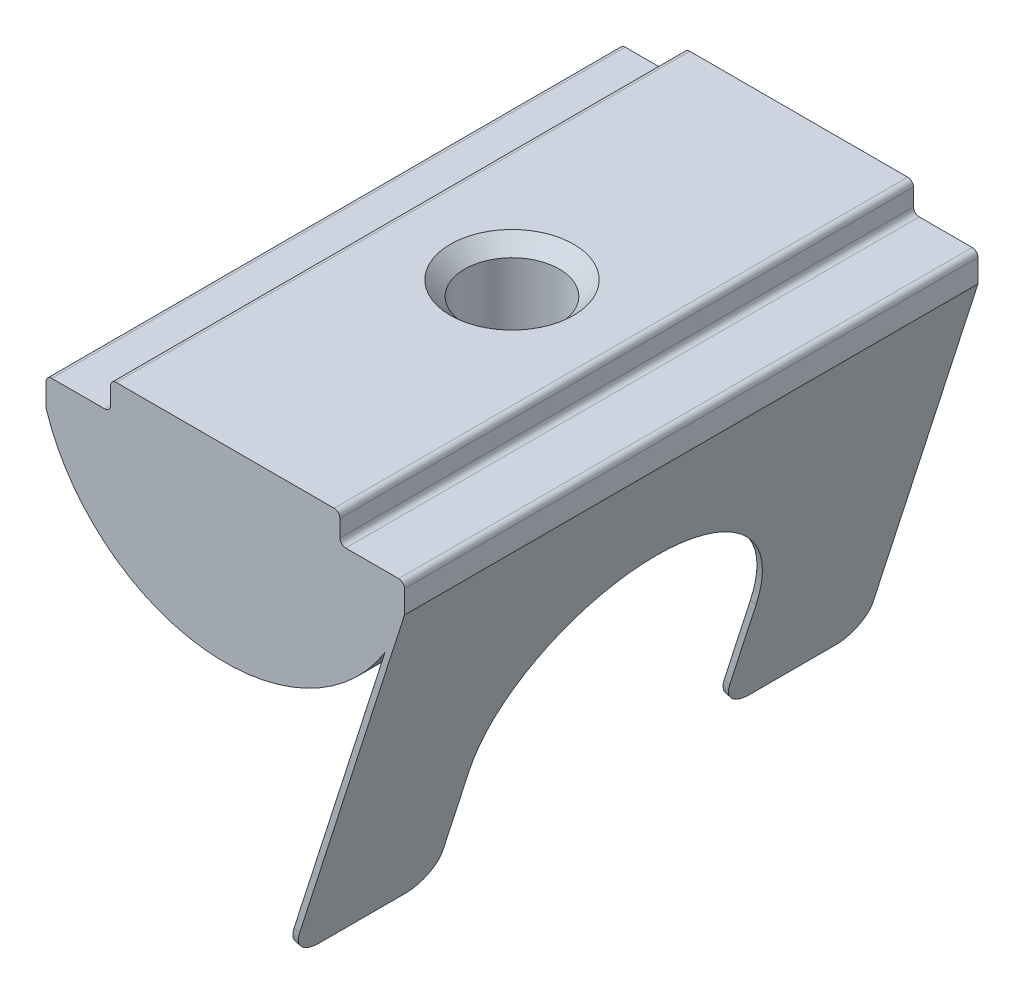
ISO-10303-21;
HEADER;
FILE_DESCRIPTION(('STEP AP214'),'2;1');
FILE_NAME('part.step','',(''),(''),'','','');
FILE_SCHEMA(('AUTOMOTIVE_DESIGN { 1 0 10303 214 1 1 1 1 }'));
ENDSEC;
DATA;
#1=APPLICATION_CONTEXT('core data for automotive mechanical design processes');
#2=APPLICATION_PROTOCOL_DEFINITION('international standard','automotive_design',2000,#1);
#3=PRODUCT_CONTEXT('',#1,'mechanical');
#4=PRODUCT('Part','Part','',(#3));
#5=PRODUCT_RELATED_PRODUCT_CATEGORY('part','',(#4));
#6=PRODUCT_DEFINITION_FORMATION('','',#4);
#7=PRODUCT_DEFINITION_CONTEXT('part definition',#1,'design');
#8=PRODUCT_DEFINITION('design','',#6,#7);
#9=PRODUCT_DEFINITION_SHAPE('','',#8);
#10=(LENGTH_UNIT() NAMED_UNIT(*) SI_UNIT(.MILLI.,.METRE.));
#11=(NAMED_UNIT(*) PLANE_ANGLE_UNIT() SI_UNIT($,.RADIAN.));
#12=(NAMED_UNIT(*) SI_UNIT($,.STERADIAN.) SOLID_ANGLE_UNIT());
#13=UNCERTAINTY_MEASURE_WITH_UNIT(LENGTH_MEASURE(1.E-05),#10,'distance_accuracy_value','');
#14=(GEOMETRIC_REPRESENTATION_CONTEXT(3) GLOBAL_UNCERTAINTY_ASSIGNED_CONTEXT((#13)) GLOBAL_UNIT_ASSIGNED_CONTEXT((#10,
#11,#12)) REPRESENTATION_CONTEXT('',''));
#15=CARTESIAN_POINT('',(0.,0.,0.));
#16=DIRECTION('',(0.,0.,1.));
#17=DIRECTION('',(1.,0.,0.));
#18=AXIS2_PLACEMENT_3D('',#15,#16,#17);
#19=CARTESIAN_POINT('',(2.09743071821094,-14.3205587681705,10.));
#20=DIRECTION('',(0.304775727103784,0.952424147199324,0.));
#21=DIRECTION('',(-0.952424147199324,0.304775727103784,0.));
#22=AXIS2_PLACEMENT_3D('',#19,#20,#21);
#23=PLANE('',#22);
#24=DIRECTION('',(0.,0.,-1.));
#25=VECTOR('',#24,1.);
#26=CARTESIAN_POINT('',(2.09743071821094,-14.3205587681705,10.));
#27=LINE('',#26,#25);
#28=CARTESIAN_POINT('',(2.09743071821094,-14.3205587681705,9.));
#29=VERTEX_POINT('',#28);
#30=CARTESIAN_POINT('',(2.09743071821094,-14.3205587681705,6.));
#31=VERTEX_POINT('',#30);
#32=EDGE_CURVE('E408',#29,#31,#27,.T.);
#33=ORIENTED_EDGE('',*,*,#32,.T.);
#34=DIRECTION('',(0.952424147199324,-0.304775727103784,0.));
#35=VECTOR('',#34,1.);
#36=CARTESIAN_POINT('',(2.09743071821094,-14.3205587681705,6.));
#37=LINE('',#36,#35);
#38=CARTESIAN_POINT('',(2.28791554765081,-14.3815139135912,6.));
#39=VERTEX_POINT('',#38);
#40=EDGE_CURVE('E364',#31,#39,#37,.T.);
#41=ORIENTED_EDGE('',*,*,#40,.T.);
#42=DIRECTION('',(0.,0.,-1.));
#43=VECTOR('',#42,1.);
#44=CARTESIAN_POINT('',(2.28791554765081,-14.3815139135912,10.));
#45=LINE('',#44,#43);
#46=CARTESIAN_POINT('',(2.28791554765081,-14.3815139135912,9.));
#47=VERTEX_POINT('',#46);
#48=EDGE_CURVE('E339',#47,#39,#45,.T.);
#49=ORIENTED_EDGE('',*,*,#48,.F.);
#50=DIRECTION('',(0.952424147199324,-0.304775727103784,0.));
#51=VECTOR('',#50,1.);
#52=CARTESIAN_POINT('',(2.09743071821094,-14.3205587681705,9.));
#53=LINE('',#52,#51);
#54=EDGE_CURVE('E362',#47,#29,#53,.F.);
#55=ORIENTED_EDGE('',*,*,#54,.T.);
#56=EDGE_LOOP('',(#33,#41,#49,#55));
#57=FACE_BOUND('',#56,.T.);
#58=ADVANCED_FACE('F37',(#57),#23,.F.);
#59=CARTESIAN_POINT('',(0.,0.,10.));
#60=DIRECTION('',(0.,0.,-1.));
#61=DIRECTION('',(-1.,0.,0.));
#62=AXIS2_PLACEMENT_3D('',#59,#60,#61);
#63=CYLINDRICAL_SURFACE('',#62,6.56220237420334);
#64=CARTESIAN_POINT('',(0.,-6.56220237420334,1.65));
#65=CARTESIAN_POINT('',(0.0911465699725093,-6.56220084465472,1.64999747323428));
#66=CARTESIAN_POINT('',(0.182321263634086,-6.56028448584091,1.64242214868128));
#67=CARTESIAN_POINT('',(0.362056452824585,-6.55282547783377,1.61236707812998));
#68=CARTESIAN_POINT('',(0.450615456568725,-6.54728079953088,1.58987899219116));
#69=CARTESIAN_POINT('',(0.622497870380307,-6.53317897020506,1.5307664217749));
#70=CARTESIAN_POINT('',(0.705827465999427,-6.52462546042665,1.49415901914898));
#71=CARTESIAN_POINT('',(0.865162951676979,-6.50541633185578,1.40790733223062));
#72=CARTESIAN_POINT('',(0.941168573902343,-6.49476063623111,1.35826257141737));
#73=CARTESIAN_POINT('',(1.08528068169072,-6.47225542325887,1.24625393910073));
#74=CARTESIAN_POINT('',(1.15321300537511,-6.460387317291,1.18366971236991));
#75=CARTESIAN_POINT('',(1.27773631367546,-6.43691803740917,1.0480304037991));
#76=CARTESIAN_POINT('',(1.33432600324174,-6.42531689410948,0.974974127940205));
#77=CARTESIAN_POINT('',(1.43537929692255,-6.4035074252856,0.819109037148414));
#78=CARTESIAN_POINT('',(1.47964761171466,-6.39332268608565,0.736170008116467));
#79=CARTESIAN_POINT('',(1.55354549547654,-6.37577045264015,0.563729824824177));
#80=CARTESIAN_POINT('',(1.58317743455914,-6.36840250230711,0.474229735713662));
#81=CARTESIAN_POINT('',(1.62636638030658,-6.35750919418608,0.293124250498835));
#82=CARTESIAN_POINT('',(1.64023675532044,-6.35390904476299,0.201598188228968));
#83=CARTESIAN_POINT('',(1.65248501145784,-6.3507351222367,0.0174528732494303));
#84=CARTESIAN_POINT('',(1.65086544406689,-6.35116068602251,-0.075166196911044));
#85=CARTESIAN_POINT('',(1.6324297075957,-6.35592290113811,-0.25646300206841));
#86=CARTESIAN_POINT('',(1.6159874358406,-6.36016331877001,-0.345181681254754));
#87=CARTESIAN_POINT('',(1.56896967631972,-6.37192402815559,-0.518559132854629));
#88=CARTESIAN_POINT('',(1.53839317133796,-6.37944455597085,-0.603217612578633));
#89=CARTESIAN_POINT('',(1.46365744495137,-6.39700612835267,-0.767071757790848));
#90=CARTESIAN_POINT('',(1.41936291600343,-6.40707208971074,-0.846202925210303));
#91=CARTESIAN_POINT('',(1.31854311212408,-6.42857633883874,-0.996043144729269));
#92=CARTESIAN_POINT('',(1.26201567424059,-6.44001486913881,-1.06675070398272));
#93=CARTESIAN_POINT('',(1.13640001591119,-6.46338022509953,-1.19987870165637));
#94=CARTESIAN_POINT('',(1.06699640233795,-6.47531161636008,-1.26200112054782));
#95=CARTESIAN_POINT('',(0.91861323583601,-6.4980208146596,-1.37378232366671));
#96=CARTESIAN_POINT('',(0.839633383826206,-6.50879858564938,-1.42344071847414));
#97=CARTESIAN_POINT('',(0.673911417471358,-6.52804083792541,-1.50899550847864));
#98=CARTESIAN_POINT('',(0.587143053260161,-6.53649707428332,-1.54484303157067));
#99=CARTESIAN_POINT('',(0.408551609952149,-6.55008353883238,-1.6013597812184));
#100=CARTESIAN_POINT('',(0.316729512956953,-6.55521441078934,-1.62203194571361));
#101=CARTESIAN_POINT('',(0.13318472375123,-6.56147659445402,-1.64715495882011));
#102=CARTESIAN_POINT('',(0.0415209052098423,-6.56270793505259,-1.65201159410124));
#103=CARTESIAN_POINT('',(-0.141309914830642,-6.56131744414824,-1.64647929626515));
#104=CARTESIAN_POINT('',(-0.232476960843278,-6.55869596377338,-1.63609175243115));
#105=CARTESIAN_POINT('',(-0.41031303892221,-6.54995852868515,-1.60070030435224));
#106=CARTESIAN_POINT('',(-0.497029053248927,-6.54389563088814,-1.57591819147075));
#107=CARTESIAN_POINT('',(-0.66506817941467,-6.52895906976587,-1.51269476944069));
#108=CARTESIAN_POINT('',(-0.746390742010012,-6.52008512070633,-1.4742520716893));
#109=CARTESIAN_POINT('',(-0.902945823871202,-6.50027167480603,-1.38401514495956));
#110=CARTESIAN_POINT('',(-0.978043232686064,-6.48929803978517,-1.33199418497377));
#111=CARTESIAN_POINT('',(-1.11858648322552,-6.46655561170397,-1.21636682464018));
#112=CARTESIAN_POINT('',(-1.18403063537711,-6.45478667997023,-1.15275840052643));
#113=CARTESIAN_POINT('',(-1.30508506172939,-6.43141934506268,-1.01387679346158));
#114=CARTESIAN_POINT('',(-1.36041054043116,-6.41983244770383,-0.938353014131709));
#115=CARTESIAN_POINT('',(-1.45760282589661,-6.39846699767141,-0.778854214872512));
#116=CARTESIAN_POINT('',(-1.49947022839064,-6.38868836496199,-0.694879569242304));
#117=CARTESIAN_POINT('',(-1.56824558656684,-6.37215485258287,-0.521311213081838));
#118=CARTESIAN_POINT('',(-1.59524213297826,-6.36538211381737,-0.431754396517959));
#119=CARTESIAN_POINT('',(-1.63374115581257,-6.35561104533575,-0.249176526999833));
#120=CARTESIAN_POINT('',(-1.64524706757122,-6.35261187876961,-0.156156246836899));
#121=CARTESIAN_POINT('',(-1.65225715632105,-6.35079183938667,0.0278085089343851));
#122=CARTESIAN_POINT('',(-1.64821672983404,-6.35185205129155,0.118734731017917));
#123=CARTESIAN_POINT('',(-1.62529227144884,-6.35775607987862,0.298564704093682));
#124=CARTESIAN_POINT('',(-1.60640854455733,-6.36259981881521,0.387468496605067));
#125=CARTESIAN_POINT('',(-1.55458356836304,-6.37545847052499,0.560228256416546));
#126=CARTESIAN_POINT('',(-1.52172866611081,-6.38345388298008,0.644111677794062));
#127=CARTESIAN_POINT('',(-1.44296215737881,-6.40171754046581,0.805235872626494));
#128=CARTESIAN_POINT('',(-1.39704871930715,-6.41198610428413,0.882475712271049));
#129=CARTESIAN_POINT('',(-1.29204474939321,-6.43397738023748,1.03031854549789));
#130=CARTESIAN_POINT('',(-1.23263866786138,-6.44573129747605,1.10069281776506));
#131=CARTESIAN_POINT('',(-1.10294941177526,-6.46918365843471,1.2306219020766));
#132=CARTESIAN_POINT('',(-1.03266365333881,-6.48088208829474,1.29017413660471));
#133=CARTESIAN_POINT('',(-0.881651154701874,-6.50316198448847,1.39783658739326));
#134=CARTESIAN_POINT('',(-0.800756265877781,-6.51371897145432,1.44571640263186));
#135=CARTESIAN_POINT('',(-0.631807047378436,-6.53226747620662,1.52712102463529));
#136=CARTESIAN_POINT('',(-0.5437578565565,-6.54026081536829,1.56065602852666));
#137=CARTESIAN_POINT('',(-0.379899735457833,-6.55161204144299,1.60749164440219));
#138=CARTESIAN_POINT('',(-0.304865388606907,-6.55555599893336,1.62339760953959));
#139=CARTESIAN_POINT('',(-0.153227238747475,-6.5608517084017,1.64465244284918));
#140=CARTESIAN_POINT('',(-0.0766235570821754,-6.56220366003841,1.65000212415867));
#141=CARTESIAN_POINT('',(0.,-6.56220237420334,1.65));
#142=B_SPLINE_CURVE_WITH_KNOTS('',3,(#64,#65,#66,#67,#68,#69,#70,#71,#72,#73,#74,#75,#76,#77,
#78,#79,#80,#81,#82,#83,#84,#85,#86,#87,#88,#89,#90,#91,#92,#93,#94,#95,#96,#97,#98,#99,#100,
#101,#102,#103,#104,#105,#106,#107,#108,#109,#110,#111,#112,#113,#114,#115,#116,#117,#118,#119,
#120,#121,#122,#123,#124,#125,#126,#127,#128,#129,#130,#131,#132,#133,#134,#135,#136,#137,#138,
#139,#140,#141),.UNSPECIFIED.,.T.,.F.,(4,2,2,2,2,2,2,2,2,2,2,2,2,2,2,2,2,2,2,2,2,2,2,2,2,2,2,2,
2,2,2,2,2,2,2,2,2,2,4),(0.,0.27315889586945,0.546470684437711,0.819452846520269,
1.09244498760208,1.37053876786725,1.64866428153456,1.93097506189691,2.21324011181646,
2.48978925814414,2.76629285239913,3.03601109555888,3.30574875289033,3.57823658984154,
3.85077264593572,4.13117323154922,4.41158257677417,4.69297527825237,4.97431348791007,
5.2483739196933,5.52240937644078,5.79233046913537,6.06227900724789,6.33706088709644,
6.61189080405545,6.8935504627651,7.17519765191266,7.45514830886784,7.73503687133626,
8.00678999815624,8.27853754101904,8.54862944945075,8.81875925970588,9.09601231447367,
9.37333131710943,9.65574700617762,9.93796160276473,10.1676138945249,10.3972484957663),.UNSPECIFIED.);
#143=CARTESIAN_POINT('',(0.,-6.56220237420334,1.65));
#144=VERTEX_POINT('',#143);
#145=EDGE_CURVE('E273',#144,#144,#142,.T.);
#146=ORIENTED_EDGE('',*,*,#145,.T.);
#147=EDGE_LOOP('',(#146));
#148=FACE_BOUND('',#147,.T.);
#149=DIRECTION('',(0.,0.,-1.));
#150=VECTOR('',#149,1.);
#151=CARTESIAN_POINT('',(5.56951001555688,-3.47031096396441,10.));
#152=LINE('',#151,#150);
#153=CARTESIAN_POINT('',(5.56951001555688,-3.47031096396441,10.));
#154=VERTEX_POINT('',#153);
#155=CARTESIAN_POINT('',(5.56951001555688,-3.47031096396441,-10.));
#156=VERTEX_POINT('',#155);
#157=EDGE_CURVE('E410',#154,#156,#152,.T.);
#158=ORIENTED_EDGE('',*,*,#157,.F.);
#159=CARTESIAN_POINT('',(0.,0.,10.));
#160=DIRECTION('',(0.,0.,1.));
#161=DIRECTION('',(1.,0.,0.));
#162=AXIS2_PLACEMENT_3D('',#159,#160,#161);
#163=CIRCLE('',#162,6.56220237420334);
#164=CARTESIAN_POINT('',(-6.25,-2.,10.));
#165=VERTEX_POINT('',#164);
#166=EDGE_CURVE('E238',#165,#154,#163,.T.);
#167=ORIENTED_EDGE('',*,*,#166,.F.);
#168=DIRECTION('',(0.,0.,-1.));
#169=VECTOR('',#168,1.);
#170=CARTESIAN_POINT('',(-6.25,-2.,10.));
#171=LINE('',#170,#169);
#172=CARTESIAN_POINT('',(-6.25,-2.,-10.));
#173=VERTEX_POINT('',#172);
#174=EDGE_CURVE('E232',#165,#173,#171,.T.);
#175=ORIENTED_EDGE('',*,*,#174,.T.);
#176=CARTESIAN_POINT('',(0.,0.,-10.));
#177=DIRECTION('',(0.,0.,1.));
#178=DIRECTION('',(1.,0.,0.));
#179=AXIS2_PLACEMENT_3D('',#176,#177,#178);
#180=CIRCLE('',#179,6.56220237420334);
#181=EDGE_CURVE('E262',#173,#156,#180,.T.);
#182=ORIENTED_EDGE('',*,*,#181,.T.);
#183=EDGE_LOOP('',(#158,#167,#175,#182));
#184=FACE_BOUND('',#183,.T.);
#185=ADVANCED_FACE('F283',(#148,#184),#63,.T.);
#186=CARTESIAN_POINT('',(4.,-0.999999999999999,10.));
#187=DIRECTION('',(-1.,0.,0.));
#188=DIRECTION('',(0.,0.,1.));
#189=AXIS2_PLACEMENT_3D('',#186,#187,#188);
#190=PLANE('',#189);
#191=DIRECTION('',(0.,1.,0.));
#192=VECTOR('',#191,1.);
#193=CARTESIAN_POINT('',(4.,-0.999999999999999,10.));
#194=LINE('',#193,#192);
#195=CARTESIAN_POINT('',(4.,-0.799999999999998,10.));
#196=VERTEX_POINT('',#195);
#197=CARTESIAN_POINT('',(4.,-0.2,10.));
#198=VERTEX_POINT('',#197);
#199=EDGE_CURVE('E269',#196,#198,#194,.T.);
#200=ORIENTED_EDGE('',*,*,#199,.F.);
#201=DIRECTION('',(0.,0.,-1.));
#202=VECTOR('',#201,1.);
#203=CARTESIAN_POINT('',(4.,-0.799999999999998,-10.));
#204=LINE('',#203,#202);
#205=CARTESIAN_POINT('',(4.,-0.799999999999998,-10.));
#206=VERTEX_POINT('',#205);
#207=EDGE_CURVE('E488',#196,#206,#204,.T.);
#208=ORIENTED_EDGE('',*,*,#207,.T.);
#209=DIRECTION('',(0.,1.,0.));
#210=VECTOR('',#209,1.);
#211=CARTESIAN_POINT('',(4.,-0.999999999999999,-10.));
#212=LINE('',#211,#210);
#213=CARTESIAN_POINT('',(4.,-0.2,-10.));
#214=VERTEX_POINT('',#213);
#215=EDGE_CURVE('E247',#206,#214,#212,.T.);
#216=ORIENTED_EDGE('',*,*,#215,.T.);
#217=DIRECTION('',(0.,0.,-1.));
#218=VECTOR('',#217,1.);
#219=CARTESIAN_POINT('',(4.,-0.2,10.));
#220=LINE('',#219,#218);
#221=EDGE_CURVE('E491',#214,#198,#220,.F.);
#222=ORIENTED_EDGE('',*,*,#221,.T.);
#223=EDGE_LOOP('',(#200,#208,#216,#222));
#224=FACE_BOUND('',#223,.T.);
#225=ADVANCED_FACE('F318',(#224),#190,.F.);
#226=CARTESIAN_POINT('',(-4.,0.,10.));
#227=DIRECTION('',(0.,-1.,0.));
#228=DIRECTION('',(0.,0.,-1.));
#229=AXIS2_PLACEMENT_3D('',#226,#227,#228);
#230=PLANE('',#229);
#231=CARTESIAN_POINT('',(0.,0.,0.));
#232=DIRECTION('',(0.,1.,0.));
#233=DIRECTION('',(0.,0.,1.));
#234=AXIS2_PLACEMENT_3D('',#231,#232,#233);
#235=CIRCLE('',#234,2.15);
#236=CARTESIAN_POINT('',(0.,0.,2.15));
#237=VERTEX_POINT('',#236);
#238=EDGE_CURVE('E413',#237,#237,#235,.T.);
#239=ORIENTED_EDGE('',*,*,#238,.F.);
#240=EDGE_LOOP('',(#239));
#241=FACE_BOUND('',#240,.T.);
#242=DIRECTION('',(-1.,0.,0.));
#243=VECTOR('',#242,1.);
#244=CARTESIAN_POINT('',(-4.,0.,10.));
#245=LINE('',#244,#243);
#246=CARTESIAN_POINT('',(3.8,0.,10.));
#247=VERTEX_POINT('',#246);
#248=CARTESIAN_POINT('',(-3.8,0.,10.));
#249=VERTEX_POINT('',#248);
#250=EDGE_CURVE('E420',#247,#249,#245,.T.);
#251=ORIENTED_EDGE('',*,*,#250,.F.);
#252=DIRECTION('',(0.,0.,-1.));
#253=VECTOR('',#252,1.);
#254=CARTESIAN_POINT('',(3.8,0.,10.));
#255=LINE('',#254,#253);
#256=CARTESIAN_POINT('',(3.8,0.,-10.));
#257=VERTEX_POINT('',#256);
#258=EDGE_CURVE('E483',#247,#257,#255,.T.);
#259=ORIENTED_EDGE('',*,*,#258,.T.);
#260=DIRECTION('',(-1.,0.,0.));
#261=VECTOR('',#260,1.);
#262=CARTESIAN_POINT('',(-4.,0.,-10.));
#263=LINE('',#262,#261);
#264=CARTESIAN_POINT('',(-3.8,0.,-10.));
#265=VERTEX_POINT('',#264);
#266=EDGE_CURVE('E250',#257,#265,#263,.T.);
#267=ORIENTED_EDGE('',*,*,#266,.T.);
#268=DIRECTION('',(0.,0.,-1.));
#269=VECTOR('',#268,1.);
#270=CARTESIAN_POINT('',(-3.8,0.,10.));
#271=LINE('',#270,#269);
#272=EDGE_CURVE('E486',#265,#249,#271,.F.);
#273=ORIENTED_EDGE('',*,*,#272,.T.);
#274=EDGE_LOOP('',(#251,#259,#267,#273));
#275=FACE_BOUND('',#274,.T.);
#276=ADVANCED_FACE('F529',(#241,#275),#230,.F.);
#277=CARTESIAN_POINT('',(-4.,0.,10.));
#278=DIRECTION('',(1.,0.,0.));
#279=DIRECTION('',(0.,0.,-1.));
#280=AXIS2_PLACEMENT_3D('',#277,#278,#279);
#281=PLANE('',#280);
#282=DIRECTION('',(0.,-1.,0.));
#283=VECTOR('',#282,1.);
#284=CARTESIAN_POINT('',(-4.,0.,-10.));
#285=LINE('',#284,#283);
#286=CARTESIAN_POINT('',(-4.,-0.2,-10.));
#287=VERTEX_POINT('',#286);
#288=CARTESIAN_POINT('',(-4.,-0.8,-10.));
#289=VERTEX_POINT('',#288);
#290=EDGE_CURVE('E254',#287,#289,#285,.T.);
#291=ORIENTED_EDGE('',*,*,#290,.T.);
#292=DIRECTION('',(0.,0.,-1.));
#293=VECTOR('',#292,1.);
#294=CARTESIAN_POINT('',(-4.,-0.8,10.));
#295=LINE('',#294,#293);
#296=CARTESIAN_POINT('',(-4.,-0.8,10.));
#297=VERTEX_POINT('',#296);
#298=EDGE_CURVE('E471',#289,#297,#295,.F.);
#299=ORIENTED_EDGE('',*,*,#298,.T.);
#300=DIRECTION('',(0.,-1.,0.));
#301=VECTOR('',#300,1.);
#302=CARTESIAN_POINT('',(-4.,0.,10.));
#303=LINE('',#302,#301);
#304=CARTESIAN_POINT('',(-4.,-0.2,10.));
#305=VERTEX_POINT('',#304);
#306=EDGE_CURVE('E423',#305,#297,#303,.T.);
#307=ORIENTED_EDGE('',*,*,#306,.F.);
#308=DIRECTION('',(0.,0.,-1.));
#309=VECTOR('',#308,1.);
#310=CARTESIAN_POINT('',(-4.,-0.2,10.));
#311=LINE('',#310,#309);
#312=EDGE_CURVE('E473',#305,#287,#311,.T.);
#313=ORIENTED_EDGE('',*,*,#312,.T.);
#314=EDGE_LOOP('',(#291,#299,#307,#313));
#315=FACE_BOUND('',#314,.T.);
#316=ADVANCED_FACE('F538',(#315),#281,.F.);
#317=CARTESIAN_POINT('',(-4.,-1.,10.));
#318=DIRECTION('',(0.,-1.,0.));
#319=DIRECTION('',(1.,0.,0.));
#320=AXIS2_PLACEMENT_3D('',#317,#318,#319);
#321=PLANE('',#320);
#322=DIRECTION('',(-1.,0.,0.));
#323=VECTOR('',#322,1.);
#324=CARTESIAN_POINT('',(-4.,-1.,-10.));
#325=LINE('',#324,#323);
#326=CARTESIAN_POINT('',(-4.2,-1.,-10.));
#327=VERTEX_POINT('',#326);
#328=CARTESIAN_POINT('',(-6.05,-1.,-10.));
#329=VERTEX_POINT('',#328);
#330=EDGE_CURVE('E257',#327,#329,#325,.T.);
#331=ORIENTED_EDGE('',*,*,#330,.T.);
#332=DIRECTION('',(0.,0.,-1.));
#333=VECTOR('',#332,1.);
#334=CARTESIAN_POINT('',(-6.05,-1.,10.));
#335=LINE('',#334,#333);
#336=CARTESIAN_POINT('',(-6.05,-1.,10.));
#337=VERTEX_POINT('',#336);
#338=EDGE_CURVE('E476',#329,#337,#335,.F.);
#339=ORIENTED_EDGE('',*,*,#338,.T.);
#340=DIRECTION('',(-1.,0.,0.));
#341=VECTOR('',#340,1.);
#342=CARTESIAN_POINT('',(-4.,-1.,10.));
#343=LINE('',#342,#341);
#344=CARTESIAN_POINT('',(-4.2,-1.,10.));
#345=VERTEX_POINT('',#344);
#346=EDGE_CURVE('E426',#345,#337,#343,.T.);
#347=ORIENTED_EDGE('',*,*,#346,.F.);
#348=DIRECTION('',(0.,0.,-1.));
#349=VECTOR('',#348,1.);
#350=CARTESIAN_POINT('',(-4.2,-1.,-10.));
#351=LINE('',#350,#349);
#352=EDGE_CURVE('E478',#345,#327,#351,.T.);
#353=ORIENTED_EDGE('',*,*,#352,.T.);
#354=EDGE_LOOP('',(#331,#339,#347,#353));
#355=FACE_BOUND('',#354,.T.);
#356=ADVANCED_FACE('F309',(#355),#321,.F.);
#357=CARTESIAN_POINT('',(-6.25,-1.,10.));
#358=DIRECTION('',(1.,0.,0.));
#359=DIRECTION('',(0.,1.,0.));
#360=AXIS2_PLACEMENT_3D('',#357,#358,#359);
#361=PLANE('',#360);
#362=DIRECTION('',(0.,-1.,0.));
#363=VECTOR('',#362,1.);
#364=CARTESIAN_POINT('',(-6.25,-1.,10.));
#365=LINE('',#364,#363);
#366=CARTESIAN_POINT('',(-6.25,-1.2,10.));
#367=VERTEX_POINT('',#366);
#368=EDGE_CURVE('E243',#367,#165,#365,.T.);
#369=ORIENTED_EDGE('',*,*,#368,.F.);
#370=DIRECTION('',(0.,0.,-1.));
#371=VECTOR('',#370,1.);
#372=CARTESIAN_POINT('',(-6.25,-1.2,10.));
#373=LINE('',#372,#371);
#374=CARTESIAN_POINT('',(-6.25,-1.2,-10.));
#375=VERTEX_POINT('',#374);
#376=EDGE_CURVE('E481',#367,#375,#373,.T.);
#377=ORIENTED_EDGE('',*,*,#376,.T.);
#378=DIRECTION('',(0.,-1.,0.));
#379=VECTOR('',#378,1.);
#380=CARTESIAN_POINT('',(-6.25,-1.,-10.));
#381=LINE('',#380,#379);
#382=EDGE_CURVE('E260',#375,#173,#381,.T.);
#383=ORIENTED_EDGE('',*,*,#382,.T.);
#384=ORIENTED_EDGE('',*,*,#174,.F.);
#385=EDGE_LOOP('',(#369,#377,#383,#384));
#386=FACE_BOUND('',#385,.T.);
#387=ADVANCED_FACE('F305',(#386),#361,.F.);
#388=CARTESIAN_POINT('',(6.25,-0.999999999999999,10.));
#389=DIRECTION('',(-1.,0.,0.));
#390=DIRECTION('',(0.,0.,1.));
#391=AXIS2_PLACEMENT_3D('',#388,#389,#390);
#392=PLANE('',#391);
#393=DIRECTION('',(0.,1.,0.));
#394=VECTOR('',#393,1.);
#395=CARTESIAN_POINT('',(6.25,-0.999999999999999,-10.));
#396=LINE('',#395,#394);
#397=CARTESIAN_POINT('',(6.25,-2.,-10.));
#398=VERTEX_POINT('',#397);
#399=CARTESIAN_POINT('',(6.25,-1.2,-10.));
#400=VERTEX_POINT('',#399);
#401=EDGE_CURVE('E265',#398,#400,#396,.T.);
#402=ORIENTED_EDGE('',*,*,#401,.T.);
#403=DIRECTION('',(0.,0.,-1.));
#404=VECTOR('',#403,1.);
#405=CARTESIAN_POINT('',(6.25,-1.2,10.));
#406=LINE('',#405,#404);
#407=CARTESIAN_POINT('',(6.25,-1.2,10.));
#408=VERTEX_POINT('',#407);
#409=EDGE_CURVE('E237',#400,#408,#406,.F.);
#410=ORIENTED_EDGE('',*,*,#409,.T.);
#411=DIRECTION('',(0.,1.,0.));
#412=VECTOR('',#411,1.);
#413=CARTESIAN_POINT('',(6.25,-0.999999999999999,10.));
#414=LINE('',#413,#412);
#415=CARTESIAN_POINT('',(6.25,-2.,10.));
#416=VERTEX_POINT('',#415);
#417=EDGE_CURVE('E216',#416,#408,#414,.T.);
#418=ORIENTED_EDGE('',*,*,#417,.F.);
#419=DIRECTION('',(0.,0.,-1.));
#420=VECTOR('',#419,1.);
#421=CARTESIAN_POINT('',(6.25,-2.,10.));
#422=LINE('',#421,#420);
#423=EDGE_CURVE('E224',#416,#398,#422,.T.);
#424=ORIENTED_EDGE('',*,*,#423,.T.);
#425=EDGE_LOOP('',(#402,#410,#418,#424));
#426=FACE_BOUND('',#425,.T.);
#427=ADVANCED_FACE('F235',(#426),#392,.F.);
#428=CARTESIAN_POINT('',(4.,-0.999999999999999,10.));
#429=DIRECTION('',(0.,-1.,0.));
#430=DIRECTION('',(1.,0.,0.));
#431=AXIS2_PLACEMENT_3D('',#428,#429,#430);
#432=PLANE('',#431);
#433=DIRECTION('',(-1.,0.,0.));
#434=VECTOR('',#433,1.);
#435=CARTESIAN_POINT('',(4.,-0.999999999999999,10.));
#436=LINE('',#435,#434);
#437=CARTESIAN_POINT('',(6.05,-0.999999999999999,10.));
#438=VERTEX_POINT('',#437);
#439=CARTESIAN_POINT('',(4.2,-0.999999999999999,10.));
#440=VERTEX_POINT('',#439);
#441=EDGE_CURVE('E233',#438,#440,#436,.T.);
#442=ORIENTED_EDGE('',*,*,#441,.F.);
#443=DIRECTION('',(0.,0.,-1.));
#444=VECTOR('',#443,1.);
#445=CARTESIAN_POINT('',(6.05,-0.999999999999999,10.));
#446=LINE('',#445,#444);
#447=CARTESIAN_POINT('',(6.05,-0.999999999999999,-10.));
#448=VERTEX_POINT('',#447);
#449=EDGE_CURVE('E508',#438,#448,#446,.T.);
#450=ORIENTED_EDGE('',*,*,#449,.T.);
#451=DIRECTION('',(-1.,0.,0.));
#452=VECTOR('',#451,1.);
#453=CARTESIAN_POINT('',(4.,-0.999999999999999,-10.));
#454=LINE('',#453,#452);
#455=CARTESIAN_POINT('',(4.2,-0.999999999999999,-10.));
#456=VERTEX_POINT('',#455);
#457=EDGE_CURVE('E267',#448,#456,#454,.T.);
#458=ORIENTED_EDGE('',*,*,#457,.T.);
#459=DIRECTION('',(0.,0.,-1.));
#460=VECTOR('',#459,1.);
#461=CARTESIAN_POINT('',(4.2,-0.999999999999999,10.));
#462=LINE('',#461,#460);
#463=EDGE_CURVE('E281',#456,#440,#462,.F.);
#464=ORIENTED_EDGE('',*,*,#463,.T.);
#465=EDGE_LOOP('',(#442,#450,#458,#464));
#466=FACE_BOUND('',#465,.T.);
#467=ADVANCED_FACE('F298',(#466),#432,.F.);
#468=CARTESIAN_POINT('',(0.,0.,10.));
#469=DIRECTION('',(0.,0.,1.));
#470=DIRECTION('',(1.,0.,0.));
#471=AXIS2_PLACEMENT_3D('',#468,#469,#470);
#472=PLANE('',#471);
#473=DIRECTION('',(-0.304775727103784,-0.952424147199324,0.));
#474=VECTOR('',#473,1.);
#475=CARTESIAN_POINT('',(6.05951517056013,-1.93904485457925,10.));
#476=LINE('',#475,#474);
#477=CARTESIAN_POINT('',(2.40220644531473,-13.3681346209711,10.));
#478=VERTEX_POINT('',#477);
#479=EDGE_CURVE('E221',#154,#478,#476,.T.);
#480=ORIENTED_EDGE('',*,*,#479,.T.);
#481=DIRECTION('',(0.952424147199324,-0.304775727103784,0.));
#482=VECTOR('',#481,1.);
#483=CARTESIAN_POINT('',(2.59269127475459,-13.4290897663919,10.));
#484=LINE('',#483,#482);
#485=CARTESIAN_POINT('',(2.59269127475459,-13.4290897663919,10.));
#486=VERTEX_POINT('',#485);
#487=EDGE_CURVE('E219',#478,#486,#484,.T.);
#488=ORIENTED_EDGE('',*,*,#487,.T.);
#489=DIRECTION('',(0.304775727103784,0.952424147199324,0.));
#490=VECTOR('',#489,1.);
#491=CARTESIAN_POINT('',(6.25,-2.,10.));
#492=LINE('',#491,#490);
#493=EDGE_CURVE('E211',#486,#416,#492,.T.);
#494=ORIENTED_EDGE('',*,*,#493,.T.);
#495=ORIENTED_EDGE('',*,*,#417,.T.);
#496=CARTESIAN_POINT('',(6.05,-1.2,10.));
#497=DIRECTION('',(0.,0.,1.));
#498=DIRECTION('',(1.,0.,0.));
#499=AXIS2_PLACEMENT_3D('',#496,#497,#498);
#500=CIRCLE('',#499,0.2);
#501=EDGE_CURVE('E493',#408,#438,#500,.T.);
#502=ORIENTED_EDGE('',*,*,#501,.T.);
#503=ORIENTED_EDGE('',*,*,#441,.T.);
#504=CARTESIAN_POINT('',(4.2,-0.799999999999998,10.));
#505=DIRECTION('',(0.,0.,1.));
#506=DIRECTION('',(1.,0.,0.));
#507=AXIS2_PLACEMENT_3D('',#504,#505,#506);
#508=CIRCLE('',#507,0.2);
#509=EDGE_CURVE('E467',#440,#196,#508,.F.);
#510=ORIENTED_EDGE('',*,*,#509,.T.);
#511=ORIENTED_EDGE('',*,*,#199,.T.);
#512=CARTESIAN_POINT('',(3.8,-0.2,10.));
#513=DIRECTION('',(0.,0.,1.));
#514=DIRECTION('',(1.,0.,0.));
#515=AXIS2_PLACEMENT_3D('',#512,#513,#514);
#516=CIRCLE('',#515,0.2);
#517=EDGE_CURVE('E495',#198,#247,#516,.T.);
#518=ORIENTED_EDGE('',*,*,#517,.T.);
#519=ORIENTED_EDGE('',*,*,#250,.T.);
#520=CARTESIAN_POINT('',(-3.8,-0.2,10.));
#521=DIRECTION('',(0.,0.,1.));
#522=DIRECTION('',(1.,0.,0.));
#523=AXIS2_PLACEMENT_3D('',#520,#521,#522);
#524=CIRCLE('',#523,0.2);
#525=EDGE_CURVE('E498',#249,#305,#524,.T.);
#526=ORIENTED_EDGE('',*,*,#525,.T.);
#527=ORIENTED_EDGE('',*,*,#306,.T.);
#528=CARTESIAN_POINT('',(-4.2,-0.8,10.));
#529=DIRECTION('',(0.,0.,1.));
#530=DIRECTION('',(1.,0.,0.));
#531=AXIS2_PLACEMENT_3D('',#528,#529,#530);
#532=CIRCLE('',#531,0.2);
#533=EDGE_CURVE('E463',#297,#345,#532,.F.);
#534=ORIENTED_EDGE('',*,*,#533,.T.);
#535=ORIENTED_EDGE('',*,*,#346,.T.);
#536=CARTESIAN_POINT('',(-6.05,-1.2,10.));
#537=DIRECTION('',(0.,0.,1.));
#538=DIRECTION('',(1.,0.,0.));
#539=AXIS2_PLACEMENT_3D('',#536,#537,#538);
#540=CIRCLE('',#539,0.2);
#541=EDGE_CURVE('E432',#337,#367,#540,.T.);
#542=ORIENTED_EDGE('',*,*,#541,.T.);
#543=ORIENTED_EDGE('',*,*,#368,.T.);
#544=ORIENTED_EDGE('',*,*,#166,.T.);
#545=EDGE_LOOP('',(#480,#488,#494,#495,#502,#503,#510,#511,#518,#519,#526,#527,#534,#535,#542,
#543,#544));
#546=FACE_BOUND('',#545,.T.);
#547=ADVANCED_FACE('F214',(#546),#472,.T.);
#548=CARTESIAN_POINT('',(0.,0.,-10.));
#549=DIRECTION('',(0.,0.,1.));
#550=DIRECTION('',(1.,0.,0.));
#551=AXIS2_PLACEMENT_3D('',#548,#549,#550);
#552=PLANE('',#551);
#553=DIRECTION('',(0.304775727103784,0.952424147199324,0.));
#554=VECTOR('',#553,1.);
#555=CARTESIAN_POINT('',(6.25,-2.,-10.));
#556=LINE('',#555,#554);
#557=CARTESIAN_POINT('',(2.59269127475459,-13.4290897663919,-10.));
#558=VERTEX_POINT('',#557);
#559=EDGE_CURVE('E228',#558,#398,#556,.T.);
#560=ORIENTED_EDGE('',*,*,#559,.F.);
#561=DIRECTION('',(0.952424147199324,-0.304775727103784,0.));
#562=VECTOR('',#561,1.);
#563=CARTESIAN_POINT('',(-3.65730872524541,-11.4290897663919,-10.));
#564=LINE('',#563,#562);
#565=CARTESIAN_POINT('',(2.40220644531473,-13.3681346209711,-10.));
#566=VERTEX_POINT('',#565);
#567=EDGE_CURVE('E360',#558,#566,#564,.F.);
#568=ORIENTED_EDGE('',*,*,#567,.T.);
#569=DIRECTION('',(-0.304775727103784,-0.952424147199324,0.));
#570=VECTOR('',#569,1.);
#571=CARTESIAN_POINT('',(6.05951517056013,-1.93904485457925,-10.));
#572=LINE('',#571,#570);
#573=EDGE_CURVE('E386',#156,#566,#572,.T.);
#574=ORIENTED_EDGE('',*,*,#573,.F.);
#575=ORIENTED_EDGE('',*,*,#181,.F.);
#576=ORIENTED_EDGE('',*,*,#382,.F.);
#577=CARTESIAN_POINT('',(-6.05,-1.2,-10.));
#578=DIRECTION('',(0.,0.,1.));
#579=DIRECTION('',(1.,0.,0.));
#580=AXIS2_PLACEMENT_3D('',#577,#578,#579);
#581=CIRCLE('',#580,0.2);
#582=EDGE_CURVE('E505',#375,#329,#581,.F.);
#583=ORIENTED_EDGE('',*,*,#582,.T.);
#584=ORIENTED_EDGE('',*,*,#330,.F.);
#585=CARTESIAN_POINT('',(-4.2,-0.8,-10.));
#586=DIRECTION('',(0.,0.,1.));
#587=DIRECTION('',(1.,0.,0.));
#588=AXIS2_PLACEMENT_3D('',#585,#586,#587);
#589=CIRCLE('',#588,0.2);
#590=EDGE_CURVE('E465',#327,#289,#589,.T.);
#591=ORIENTED_EDGE('',*,*,#590,.T.);
#592=ORIENTED_EDGE('',*,*,#290,.F.);
#593=CARTESIAN_POINT('',(-3.8,-0.2,-10.));
#594=DIRECTION('',(0.,0.,1.));
#595=DIRECTION('',(1.,0.,0.));
#596=AXIS2_PLACEMENT_3D('',#593,#594,#595);
#597=CIRCLE('',#596,0.2);
#598=EDGE_CURVE('E507',#287,#265,#597,.F.);
#599=ORIENTED_EDGE('',*,*,#598,.T.);
#600=ORIENTED_EDGE('',*,*,#266,.F.);
#601=CARTESIAN_POINT('',(3.8,-0.2,-10.));
#602=DIRECTION('',(0.,0.,1.));
#603=DIRECTION('',(1.,0.,0.));
#604=AXIS2_PLACEMENT_3D('',#601,#602,#603);
#605=CIRCLE('',#604,0.2);
#606=EDGE_CURVE('E503',#257,#214,#605,.F.);
#607=ORIENTED_EDGE('',*,*,#606,.T.);
#608=ORIENTED_EDGE('',*,*,#215,.F.);
#609=CARTESIAN_POINT('',(4.2,-0.799999999999998,-10.));
#610=DIRECTION('',(0.,0.,1.));
#611=DIRECTION('',(1.,0.,0.));
#612=AXIS2_PLACEMENT_3D('',#609,#610,#611);
#613=CIRCLE('',#612,0.2);
#614=EDGE_CURVE('E469',#206,#456,#613,.T.);
#615=ORIENTED_EDGE('',*,*,#614,.T.);
#616=ORIENTED_EDGE('',*,*,#457,.F.);
#617=CARTESIAN_POINT('',(6.05,-1.2,-10.));
#618=DIRECTION('',(0.,0.,1.));
#619=DIRECTION('',(1.,0.,0.));
#620=AXIS2_PLACEMENT_3D('',#617,#618,#619);
#621=CIRCLE('',#620,0.2);
#622=EDGE_CURVE('E501',#448,#400,#621,.F.);
#623=ORIENTED_EDGE('',*,*,#622,.T.);
#624=ORIENTED_EDGE('',*,*,#401,.F.);
#625=EDGE_LOOP('',(#560,#568,#574,#575,#576,#583,#584,#591,#592,#599,#600,#607,#608,#615,#616,
#623,#624));
#626=FACE_BOUND('',#625,.T.);
#627=ADVANCED_FACE('F293',(#626),#552,.F.);
#628=CARTESIAN_POINT('',(0.,0.,0.));
#629=DIRECTION('',(0.,1.,0.));
#630=DIRECTION('',(0.,0.,1.));
#631=AXIS2_PLACEMENT_3D('',#628,#629,#630);
#632=CYLINDRICAL_SURFACE('',#631,1.65);
#633=CARTESIAN_POINT('',(0.,-0.499999999999999,0.));
#634=DIRECTION('',(0.,1.,0.));
#635=DIRECTION('',(0.,0.,1.));
#636=AXIS2_PLACEMENT_3D('',#633,#634,#635);
#637=CIRCLE('',#636,1.65);
#638=CARTESIAN_POINT('',(0.,-0.499999999999999,1.65));
#639=VERTEX_POINT('',#638);
#640=EDGE_CURVE('E251',#639,#639,#637,.T.);
#641=ORIENTED_EDGE('',*,*,#640,.T.);
#642=EDGE_LOOP('',(#641));
#643=FACE_BOUND('',#642,.T.);
#644=ORIENTED_EDGE('',*,*,#145,.F.);
#645=EDGE_LOOP('',(#644));
#646=FACE_BOUND('',#645,.T.);
#647=ADVANCED_FACE('F287',(#643,#646),#632,.F.);
#648=CARTESIAN_POINT('',(0.,0.,0.));
#649=DIRECTION('',(0.,1.,0.));
#650=DIRECTION('',(0.,0.,1.));
#651=AXIS2_PLACEMENT_3D('',#648,#649,#650);
#652=CONICAL_SURFACE('',#651,2.15,0.78539816339745);
#653=ORIENTED_EDGE('',*,*,#640,.F.);
#654=EDGE_LOOP('',(#653));
#655=FACE_BOUND('',#654,.T.);
#656=ORIENTED_EDGE('',*,*,#238,.T.);
#657=EDGE_LOOP('',(#656));
#658=FACE_BOUND('',#657,.T.);
#659=ADVANCED_FACE('F292',(#655,#658),#652,.F.);
#660=CARTESIAN_POINT('',(6.05951517056013,-1.93904485457925,10.));
#661=DIRECTION('',(0.952424147199324,-0.304775727103784,0.));
#662=DIRECTION('',(0.304775727103784,0.952424147199324,0.));
#663=AXIS2_PLACEMENT_3D('',#660,#661,#662);
#664=PLANE('',#663);
#665=CARTESIAN_POINT('',(2.09743071821094,-14.3205587681705,-6.));
#666=VERTEX_POINT('',#665);
#667=CARTESIAN_POINT('',(2.09743071821094,-14.3205587681705,-9.));
#668=VERTEX_POINT('',#667);
#669=EDGE_CURVE('E411',#666,#668,#27,.T.);
#670=ORIENTED_EDGE('',*,*,#669,.F.);
#671=CARTESIAN_POINT('',(2.40220644531473,-13.3681346209711,-6.));
#672=DIRECTION('',(0.952424147199324,-0.304775727103784,0.));
#673=DIRECTION('',(0.304775727103784,0.952424147199324,0.));
#674=AXIS2_PLACEMENT_3D('',#671,#672,#673);
#675=CIRCLE('',#674,1.);
#676=CARTESIAN_POINT('',(2.40220644531473,-13.3681346209711,-5.));
#677=VERTEX_POINT('',#676);
#678=EDGE_CURVE('E348',#666,#677,#675,.F.);
#679=ORIENTED_EDGE('',*,*,#678,.T.);
#680=DIRECTION('',(-0.304775727103784,-0.952424147199324,0.));
#681=VECTOR('',#680,1.);
#682=CARTESIAN_POINT('',(2.09743071821094,-14.3205587681705,-5.));
#683=LINE('',#682,#681);
#684=CARTESIAN_POINT('',(3.31653362662608,-10.5108621793732,-5.));
#685=VERTEX_POINT('',#684);
#686=EDGE_CURVE('E391',#685,#677,#683,.T.);
#687=ORIENTED_EDGE('',*,*,#686,.F.);
#688=CARTESIAN_POINT('',(3.31653362662608,-10.5108621793732,0.));
#689=DIRECTION('',(0.952424147199324,-0.304775727103784,0.));
#690=DIRECTION('',(0.304775727103784,0.952424147199324,0.));
#691=AXIS2_PLACEMENT_3D('',#688,#689,#690);
#692=CIRCLE('',#691,5.);
#693=CARTESIAN_POINT('',(4.840412262145,-5.74874144337654,0.));
#694=VERTEX_POINT('',#693);
#695=EDGE_CURVE('E11',#685,#694,#692,.T.);
#696=ORIENTED_EDGE('',*,*,#695,.T.);
#697=CARTESIAN_POINT('',(3.31653362662608,-10.5108621793732,0.));
#698=DIRECTION('',(0.952424147199324,-0.304775727103784,0.));
#699=DIRECTION('',(0.304775727103784,0.952424147199324,0.));
#700=AXIS2_PLACEMENT_3D('',#697,#698,#699);
#701=CIRCLE('',#700,5.);
#702=CARTESIAN_POINT('',(3.31653362662608,-10.5108621793732,5.));
#703=VERTEX_POINT('',#702);
#704=EDGE_CURVE('E376',#694,#703,#701,.T.);
#705=ORIENTED_EDGE('',*,*,#704,.T.);
#706=DIRECTION('',(0.304775727103784,0.952424147199324,0.));
#707=VECTOR('',#706,1.);
#708=CARTESIAN_POINT('',(2.09743071821094,-14.3205587681705,5.));
#709=LINE('',#708,#707);
#710=CARTESIAN_POINT('',(2.40220644531473,-13.3681346209711,5.));
#711=VERTEX_POINT('',#710);
#712=EDGE_CURVE('E396',#711,#703,#709,.T.);
#713=ORIENTED_EDGE('',*,*,#712,.F.);
#714=CARTESIAN_POINT('',(2.40220644531473,-13.3681346209711,6.));
#715=DIRECTION('',(0.952424147199324,-0.304775727103784,0.));
#716=DIRECTION('',(0.304775727103784,0.952424147199324,0.));
#717=AXIS2_PLACEMENT_3D('',#714,#715,#716);
#718=CIRCLE('',#717,1.);
#719=EDGE_CURVE('E351',#711,#31,#718,.F.);
#720=ORIENTED_EDGE('',*,*,#719,.T.);
#721=ORIENTED_EDGE('',*,*,#32,.F.);
#722=CARTESIAN_POINT('',(2.40220644531472,-13.3681346209711,9.));
#723=DIRECTION('',(0.952424147199324,-0.304775727103784,0.));
#724=DIRECTION('',(0.304775727103784,0.952424147199324,0.));
#725=AXIS2_PLACEMENT_3D('',#722,#723,#724);
#726=CIRCLE('',#725,1.);
#727=EDGE_CURVE('E349',#29,#478,#726,.F.);
#728=ORIENTED_EDGE('',*,*,#727,.T.);
#729=ORIENTED_EDGE('',*,*,#479,.F.);
#730=ORIENTED_EDGE('',*,*,#157,.T.);
#731=ORIENTED_EDGE('',*,*,#573,.T.);
#732=CARTESIAN_POINT('',(2.40220644531473,-13.3681346209711,-9.));
#733=DIRECTION('',(0.952424147199324,-0.304775727103784,0.));
#734=DIRECTION('',(0.304775727103784,0.952424147199324,0.));
#735=AXIS2_PLACEMENT_3D('',#732,#733,#734);
#736=CIRCLE('',#735,1.);
#737=EDGE_CURVE('E357',#566,#668,#736,.F.);
#738=ORIENTED_EDGE('',*,*,#737,.T.);
#739=EDGE_LOOP('',(#670,#679,#687,#696,#705,#713,#720,#721,#728,#729,#730,#731,#738));
#740=FACE_BOUND('',#739,.T.);
#741=ADVANCED_FACE('F323',(#740),#664,.F.);
#742=CARTESIAN_POINT('',(2.28791554765081,-14.3815139135912,-6.));
#743=VERTEX_POINT('',#742);
#744=CARTESIAN_POINT('',(2.28791554765081,-14.3815139135912,-9.));
#745=VERTEX_POINT('',#744);
#746=EDGE_CURVE('E220',#743,#745,#45,.T.);
#747=ORIENTED_EDGE('',*,*,#746,.F.);
#748=DIRECTION('',(0.952424147199324,-0.304775727103784,0.));
#749=VECTOR('',#748,1.);
#750=CARTESIAN_POINT('',(2.09743071821094,-14.3205587681705,-6.));
#751=LINE('',#750,#749);
#752=EDGE_CURVE('E335',#743,#666,#751,.F.);
#753=ORIENTED_EDGE('',*,*,#752,.T.);
#754=ORIENTED_EDGE('',*,*,#669,.T.);
#755=DIRECTION('',(0.952424147199324,-0.304775727103784,0.));
#756=VECTOR('',#755,1.);
#757=CARTESIAN_POINT('',(2.09743071821094,-14.3205587681705,-9.));
#758=LINE('',#757,#756);
#759=EDGE_CURVE('E338',#668,#745,#758,.T.);
#760=ORIENTED_EDGE('',*,*,#759,.T.);
#761=EDGE_LOOP('',(#747,#753,#754,#760));
#762=FACE_BOUND('',#761,.T.);
#763=ADVANCED_FACE('F314',(#762),#23,.F.);
#764=CARTESIAN_POINT('',(6.25,-2.,10.));
#765=DIRECTION('',(-0.952424147199324,0.304775727103784,0.));
#766=DIRECTION('',(-0.304775727103784,-0.952424147199324,0.));
#767=AXIS2_PLACEMENT_3D('',#764,#765,#766);
#768=PLANE('',#767);
#769=DIRECTION('',(0.304775727103784,0.952424147199324,0.));
#770=VECTOR('',#769,1.);
#771=CARTESIAN_POINT('',(2.28791554765081,-14.3815139135912,-5.));
#772=LINE('',#771,#770);
#773=CARTESIAN_POINT('',(2.59269127475459,-13.4290897663919,-5.));
#774=VERTEX_POINT('',#773);
#775=CARTESIAN_POINT('',(3.50701845606594,-10.5718173247939,-5.));
#776=VERTEX_POINT('',#775);
#777=EDGE_CURVE('E379',#774,#776,#772,.T.);
#778=ORIENTED_EDGE('',*,*,#777,.F.);
#779=CARTESIAN_POINT('',(2.59269127475459,-13.4290897663919,-6.));
#780=DIRECTION('',(-0.952424147199324,0.304775727103784,0.));
#781=DIRECTION('',(-0.304775727103784,-0.952424147199324,0.));
#782=AXIS2_PLACEMENT_3D('',#779,#780,#781);
#783=CIRCLE('',#782,1.);
#784=EDGE_CURVE('E345',#774,#743,#783,.F.);
#785=ORIENTED_EDGE('',*,*,#784,.T.);
#786=ORIENTED_EDGE('',*,*,#746,.T.);
#787=CARTESIAN_POINT('',(2.59269127475459,-13.4290897663919,-9.));
#788=DIRECTION('',(-0.952424147199324,0.304775727103784,0.));
#789=DIRECTION('',(-0.304775727103784,-0.952424147199324,0.));
#790=AXIS2_PLACEMENT_3D('',#787,#788,#789);
#791=CIRCLE('',#790,1.);
#792=EDGE_CURVE('E444',#745,#558,#791,.F.);
#793=ORIENTED_EDGE('',*,*,#792,.T.);
#794=ORIENTED_EDGE('',*,*,#559,.T.);
#795=ORIENTED_EDGE('',*,*,#423,.F.);
#796=ORIENTED_EDGE('',*,*,#493,.F.);
#797=CARTESIAN_POINT('',(2.59269127475459,-13.4290897663919,9.));
#798=DIRECTION('',(-0.952424147199324,0.304775727103784,0.));
#799=DIRECTION('',(-0.304775727103784,-0.952424147199324,0.));
#800=AXIS2_PLACEMENT_3D('',#797,#798,#799);
#801=CIRCLE('',#800,1.);
#802=EDGE_CURVE('E449',#486,#47,#801,.F.);
#803=ORIENTED_EDGE('',*,*,#802,.T.);
#804=ORIENTED_EDGE('',*,*,#48,.T.);
#805=CARTESIAN_POINT('',(2.59269127475459,-13.4290897663919,6.));
#806=DIRECTION('',(-0.952424147199324,0.304775727103784,0.));
#807=DIRECTION('',(-0.304775727103784,-0.952424147199324,0.));
#808=AXIS2_PLACEMENT_3D('',#805,#806,#807);
#809=CIRCLE('',#808,1.);
#810=CARTESIAN_POINT('',(2.59269127475459,-13.4290897663919,5.));
#811=VERTEX_POINT('',#810);
#812=EDGE_CURVE('E448',#39,#811,#809,.F.);
#813=ORIENTED_EDGE('',*,*,#812,.T.);
#814=DIRECTION('',(-0.304775727103784,-0.952424147199324,0.));
#815=VECTOR('',#814,1.);
#816=CARTESIAN_POINT('',(2.28791554765081,-14.3815139135912,5.));
#817=LINE('',#816,#815);
#818=CARTESIAN_POINT('',(3.50701845606594,-10.5718173247939,5.));
#819=VERTEX_POINT('',#818);
#820=EDGE_CURVE('E387',#819,#811,#817,.T.);
#821=ORIENTED_EDGE('',*,*,#820,.F.);
#822=CARTESIAN_POINT('',(3.50701845606594,-10.5718173247939,0.));
#823=DIRECTION('',(-0.952424147199324,0.304775727103784,0.));
#824=DIRECTION('',(-0.304775727103784,-0.952424147199324,0.));
#825=AXIS2_PLACEMENT_3D('',#822,#823,#824);
#826=CIRCLE('',#825,5.);
#827=CARTESIAN_POINT('',(5.03089709158486,-5.8096965887973,0.));
#828=VERTEX_POINT('',#827);
#829=EDGE_CURVE('E59',#819,#828,#826,.T.);
#830=ORIENTED_EDGE('',*,*,#829,.T.);
#831=CARTESIAN_POINT('',(3.50701845606594,-10.5718173247939,0.));
#832=DIRECTION('',(-0.952424147199324,0.304775727103784,0.));
#833=DIRECTION('',(-0.304775727103784,-0.952424147199324,0.));
#834=AXIS2_PLACEMENT_3D('',#831,#832,#833);
#835=CIRCLE('',#834,5.);
#836=EDGE_CURVE('E46',#828,#776,#835,.T.);
#837=ORIENTED_EDGE('',*,*,#836,.T.);
#838=EDGE_LOOP('',(#778,#785,#786,#793,#794,#795,#796,#803,#804,#813,#821,#830,#837));
#839=FACE_BOUND('',#838,.T.);
#840=ADVANCED_FACE('F226',(#839),#768,.F.);
#841=CARTESIAN_POINT('',(-9.63273031591959,-10.5669072372487,5.));
#842=DIRECTION('',(0.,0.,1.));
#843=DIRECTION('',(1.,0.,0.));
#844=AXIS2_PLACEMENT_3D('',#841,#842,#843);
#845=PLANE('',#844);
#846=ORIENTED_EDGE('',*,*,#712,.T.);
#847=DIRECTION('',(0.952424147199324,-0.304775727103784,0.));
#848=VECTOR('',#847,1.);
#849=CARTESIAN_POINT('',(3.50701845606594,-10.5718173247939,5.));
#850=LINE('',#849,#848);
#851=EDGE_CURVE('E370',#703,#819,#850,.T.);
#852=ORIENTED_EDGE('',*,*,#851,.T.);
#853=ORIENTED_EDGE('',*,*,#820,.T.);
#854=DIRECTION('',(0.952424147199324,-0.304775727103784,0.));
#855=VECTOR('',#854,1.);
#856=CARTESIAN_POINT('',(-9.32795458881581,-9.61448309004936,5.));
#857=LINE('',#856,#855);
#858=EDGE_CURVE('E367',#811,#711,#857,.F.);
#859=ORIENTED_EDGE('',*,*,#858,.T.);
#860=EDGE_LOOP('',(#846,#852,#853,#859));
#861=FACE_BOUND('',#860,.T.);
#862=ADVANCED_FACE('F329',(#861),#845,.F.);
#863=CARTESIAN_POINT('',(-9.63273031591959,-10.5669072372487,-5.));
#864=DIRECTION('',(0.,0.,-1.));
#865=DIRECTION('',(-1.,0.,0.));
#866=AXIS2_PLACEMENT_3D('',#863,#864,#865);
#867=PLANE('',#866);
#868=ORIENTED_EDGE('',*,*,#777,.T.);
#869=DIRECTION('',(0.952424147199324,-0.304775727103784,0.));
#870=VECTOR('',#869,1.);
#871=CARTESIAN_POINT('',(3.31653362662608,-10.5108621793732,-5.));
#872=LINE('',#871,#870);
#873=EDGE_CURVE('E373',#776,#685,#872,.F.);
#874=ORIENTED_EDGE('',*,*,#873,.T.);
#875=ORIENTED_EDGE('',*,*,#686,.T.);
#876=DIRECTION('',(0.952424147199324,-0.304775727103784,0.));
#877=VECTOR('',#876,1.);
#878=CARTESIAN_POINT('',(-9.32795458881581,-9.61448309004936,-5.));
#879=LINE('',#878,#877);
#880=EDGE_CURVE('E385',#677,#774,#879,.T.);
#881=ORIENTED_EDGE('',*,*,#880,.T.);
#882=EDGE_LOOP('',(#868,#874,#875,#881));
#883=FACE_BOUND('',#882,.T.);
#884=ADVANCED_FACE('F384',(#883),#867,.F.);
#885=CARTESIAN_POINT('',(6.05,-1.2,10.));
#886=DIRECTION('',(0.,0.,-1.));
#887=DIRECTION('',(-1.,0.,0.));
#888=AXIS2_PLACEMENT_3D('',#885,#886,#887);
#889=CYLINDRICAL_SURFACE('',#888,0.2);
#890=ORIENTED_EDGE('',*,*,#501,.F.);
#891=ORIENTED_EDGE('',*,*,#409,.F.);
#892=ORIENTED_EDGE('',*,*,#622,.F.);
#893=ORIENTED_EDGE('',*,*,#449,.F.);
#894=EDGE_LOOP('',(#890,#891,#892,#893));
#895=FACE_BOUND('',#894,.T.);
#896=ADVANCED_FACE('F620',(#895),#889,.T.);
#897=CARTESIAN_POINT('',(4.2,-0.799999999999998,10.));
#898=DIRECTION('',(0.,0.,1.));
#899=DIRECTION('',(1.,0.,0.));
#900=AXIS2_PLACEMENT_3D('',#897,#898,#899);
#901=CYLINDRICAL_SURFACE('',#900,0.2);
#902=ORIENTED_EDGE('',*,*,#509,.F.);
#903=ORIENTED_EDGE('',*,*,#463,.F.);
#904=ORIENTED_EDGE('',*,*,#614,.F.);
#905=ORIENTED_EDGE('',*,*,#207,.F.);
#906=EDGE_LOOP('',(#902,#903,#904,#905));
#907=FACE_BOUND('',#906,.T.);
#908=ADVANCED_FACE('F518',(#907),#901,.F.);
#909=CARTESIAN_POINT('',(3.8,-0.2,10.));
#910=DIRECTION('',(0.,0.,-1.));
#911=DIRECTION('',(-1.,0.,0.));
#912=AXIS2_PLACEMENT_3D('',#909,#910,#911);
#913=CYLINDRICAL_SURFACE('',#912,0.2);
#914=ORIENTED_EDGE('',*,*,#517,.F.);
#915=ORIENTED_EDGE('',*,*,#221,.F.);
#916=ORIENTED_EDGE('',*,*,#606,.F.);
#917=ORIENTED_EDGE('',*,*,#258,.F.);
#918=EDGE_LOOP('',(#914,#915,#916,#917));
#919=FACE_BOUND('',#918,.T.);
#920=ADVANCED_FACE('F526',(#919),#913,.T.);
#921=CARTESIAN_POINT('',(-6.05,-1.2,10.));
#922=DIRECTION('',(0.,0.,-1.));
#923=DIRECTION('',(-1.,0.,0.));
#924=AXIS2_PLACEMENT_3D('',#921,#922,#923);
#925=CYLINDRICAL_SURFACE('',#924,0.2);
#926=ORIENTED_EDGE('',*,*,#541,.F.);
#927=ORIENTED_EDGE('',*,*,#338,.F.);
#928=ORIENTED_EDGE('',*,*,#582,.F.);
#929=ORIENTED_EDGE('',*,*,#376,.F.);
#930=EDGE_LOOP('',(#926,#927,#928,#929));
#931=FACE_BOUND('',#930,.T.);
#932=ADVANCED_FACE('F549',(#931),#925,.T.);
#933=CARTESIAN_POINT('',(-4.2,-0.8,10.));
#934=DIRECTION('',(0.,0.,1.));
#935=DIRECTION('',(1.,0.,0.));
#936=AXIS2_PLACEMENT_3D('',#933,#934,#935);
#937=CYLINDRICAL_SURFACE('',#936,0.2);
#938=ORIENTED_EDGE('',*,*,#533,.F.);
#939=ORIENTED_EDGE('',*,*,#298,.F.);
#940=ORIENTED_EDGE('',*,*,#590,.F.);
#941=ORIENTED_EDGE('',*,*,#352,.F.);
#942=EDGE_LOOP('',(#938,#939,#940,#941));
#943=FACE_BOUND('',#942,.T.);
#944=ADVANCED_FACE('F544',(#943),#937,.F.);
#945=CARTESIAN_POINT('',(-3.8,-0.2,10.));
#946=DIRECTION('',(0.,0.,-1.));
#947=DIRECTION('',(-1.,0.,0.));
#948=AXIS2_PLACEMENT_3D('',#945,#946,#947);
#949=CYLINDRICAL_SURFACE('',#948,0.2);
#950=ORIENTED_EDGE('',*,*,#525,.F.);
#951=ORIENTED_EDGE('',*,*,#272,.F.);
#952=ORIENTED_EDGE('',*,*,#598,.F.);
#953=ORIENTED_EDGE('',*,*,#312,.F.);
#954=EDGE_LOOP('',(#950,#951,#952,#953));
#955=FACE_BOUND('',#954,.T.);
#956=ADVANCED_FACE('F535',(#955),#949,.T.);
#957=CARTESIAN_POINT('',(-9.32795458881581,-9.61448309004936,-6.));
#958=DIRECTION('',(0.952424147199324,-0.304775727103784,0.));
#959=DIRECTION('',(0.304775727103784,0.952424147199324,0.));
#960=AXIS2_PLACEMENT_3D('',#957,#958,#959);
#961=CYLINDRICAL_SURFACE('',#960,1.);
#962=ORIENTED_EDGE('',*,*,#678,.F.);
#963=ORIENTED_EDGE('',*,*,#752,.F.);
#964=ORIENTED_EDGE('',*,*,#784,.F.);
#965=ORIENTED_EDGE('',*,*,#880,.F.);
#966=EDGE_LOOP('',(#962,#963,#964,#965));
#967=FACE_BOUND('',#966,.T.);
#968=ADVANCED_FACE('F343',(#967),#961,.T.);
#969=CARTESIAN_POINT('',(2.40220644531472,-13.3681346209711,-9.));
#970=DIRECTION('',(0.952424147199324,-0.304775727103784,0.));
#971=DIRECTION('',(0.304775727103784,0.952424147199324,0.));
#972=AXIS2_PLACEMENT_3D('',#969,#970,#971);
#973=CYLINDRICAL_SURFACE('',#972,1.);
#974=ORIENTED_EDGE('',*,*,#737,.F.);
#975=ORIENTED_EDGE('',*,*,#567,.F.);
#976=ORIENTED_EDGE('',*,*,#792,.F.);
#977=ORIENTED_EDGE('',*,*,#759,.F.);
#978=EDGE_LOOP('',(#974,#975,#976,#977));
#979=FACE_BOUND('',#978,.T.);
#980=ADVANCED_FACE('F443',(#979),#973,.T.);
#981=CARTESIAN_POINT('',(2.40220644531472,-13.3681346209711,6.));
#982=DIRECTION('',(0.952424147199324,-0.304775727103784,0.));
#983=DIRECTION('',(0.304775727103784,0.952424147199324,0.));
#984=AXIS2_PLACEMENT_3D('',#981,#982,#983);
#985=CYLINDRICAL_SURFACE('',#984,1.);
#986=ORIENTED_EDGE('',*,*,#719,.F.);
#987=ORIENTED_EDGE('',*,*,#858,.F.);
#988=ORIENTED_EDGE('',*,*,#812,.F.);
#989=ORIENTED_EDGE('',*,*,#40,.F.);
#990=EDGE_LOOP('',(#986,#987,#988,#989));
#991=FACE_BOUND('',#990,.T.);
#992=ADVANCED_FACE('F457',(#991),#985,.T.);
#993=CARTESIAN_POINT('',(-3.65730872524541,-11.4290897663919,9.));
#994=DIRECTION('',(-0.952424147199324,0.304775727103784,0.));
#995=DIRECTION('',(-0.304775727103784,-0.952424147199324,0.));
#996=AXIS2_PLACEMENT_3D('',#993,#994,#995);
#997=CYLINDRICAL_SURFACE('',#996,1.);
#998=ORIENTED_EDGE('',*,*,#727,.F.);
#999=ORIENTED_EDGE('',*,*,#54,.F.);
#1000=ORIENTED_EDGE('',*,*,#802,.F.);
#1001=ORIENTED_EDGE('',*,*,#487,.F.);
#1002=EDGE_LOOP('',(#998,#999,#1000,#1001));
#1003=FACE_BOUND('',#1002,.T.);
#1004=ADVANCED_FACE('F455',(#1003),#997,.T.);
#1005=CARTESIAN_POINT('',(-8.41362740750445,-6.75721064845139,0.));
#1006=DIRECTION('',(-0.952424147199324,0.304775727103784,0.));
#1007=DIRECTION('',(-0.304775727103784,-0.952424147199324,0.));
#1008=AXIS2_PLACEMENT_3D('',#1005,#1006,#1007);
#1009=CYLINDRICAL_SURFACE('',#1008,5.);
#1010=DIRECTION('',(0.952424147199324,-0.304775727103784,0.));
#1011=VECTOR('',#1010,1.);
#1012=CARTESIAN_POINT('',(5.03089709158486,-5.8096965887973,0.));
#1013=LINE('',#1012,#1011);
#1014=EDGE_CURVE('E41',#694,#828,#1013,.T.);
#1015=ORIENTED_EDGE('',*,*,#1014,.F.);
#1016=ORIENTED_EDGE('',*,*,#695,.F.);
#1017=ORIENTED_EDGE('',*,*,#873,.F.);
#1018=ORIENTED_EDGE('',*,*,#836,.F.);
#1019=EDGE_LOOP('',(#1015,#1016,#1017,#1018));
#1020=FACE_BOUND('',#1019,.T.);
#1021=ADVANCED_FACE('F39',(#1020),#1009,.F.);
#1022=CARTESIAN_POINT('',(-8.41362740750445,-6.75721064845139,0.));
#1023=DIRECTION('',(-0.952424147199324,0.304775727103784,0.));
#1024=DIRECTION('',(-0.304775727103784,-0.952424147199324,0.));
#1025=AXIS2_PLACEMENT_3D('',#1022,#1023,#1024);
#1026=CYLINDRICAL_SURFACE('',#1025,5.);
#1027=ORIENTED_EDGE('',*,*,#704,.F.);
#1028=ORIENTED_EDGE('',*,*,#1014,.T.);
#1029=ORIENTED_EDGE('',*,*,#829,.F.);
#1030=ORIENTED_EDGE('',*,*,#851,.F.);
#1031=EDGE_LOOP('',(#1027,#1028,#1029,#1030));
#1032=FACE_BOUND('',#1031,.T.);
#1033=ADVANCED_FACE('F393',(#1032),#1026,.F.);
#1034=CLOSED_SHELL('',(#58,#185,#225,#276,#316,#356,#387,#427,#467,#547,#627,#647,#659,#741,
#763,#840,#862,#884,#896,#908,#920,#932,#944,#956,#968,#980,#992,#1004,#1021,#1033));
#1035=MANIFOLD_SOLID_BREP('B2',#1034);
#1036=ADVANCED_BREP_SHAPE_REPRESENTATION('',(#18,#1035),#14);
#1037=SHAPE_DEFINITION_REPRESENTATION(#9,#1036);
ENDSEC;
END-ISO-10303-21;
